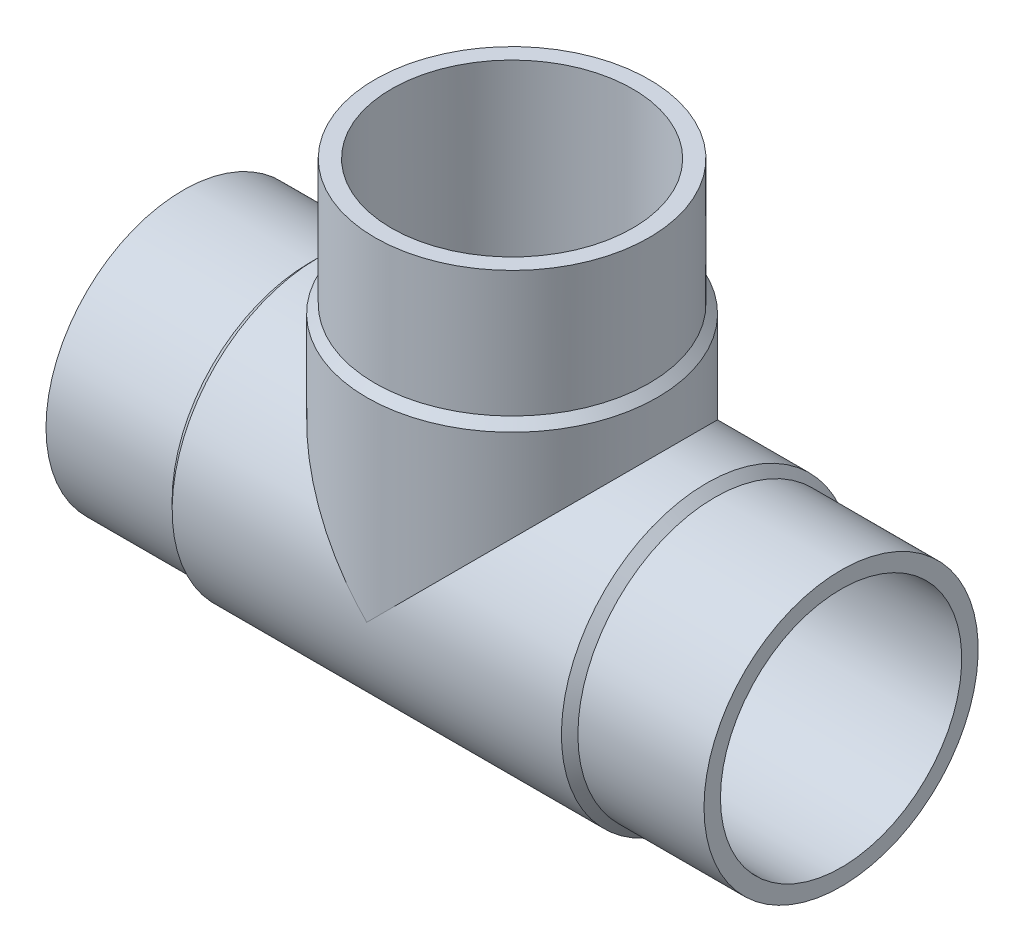
ISO-10303-21;
HEADER;
FILE_DESCRIPTION(('STEP AP214'),'2;1');
FILE_NAME('part.step','',(''),(''),'','','');
FILE_SCHEMA(('AUTOMOTIVE_DESIGN { 1 0 10303 214 1 1 1 1 }'));
ENDSEC;
DATA;
#1=APPLICATION_CONTEXT('core data for automotive mechanical design processes');
#2=APPLICATION_PROTOCOL_DEFINITION('international standard','automotive_design',2000,#1);
#3=PRODUCT_CONTEXT('',#1,'mechanical');
#4=PRODUCT('Part','Part','',(#3));
#5=PRODUCT_RELATED_PRODUCT_CATEGORY('part','',(#4));
#6=PRODUCT_DEFINITION_FORMATION('','',#4);
#7=PRODUCT_DEFINITION_CONTEXT('part definition',#1,'design');
#8=PRODUCT_DEFINITION('design','',#6,#7);
#9=PRODUCT_DEFINITION_SHAPE('','',#8);
#10=(LENGTH_UNIT() NAMED_UNIT(*) SI_UNIT(.MILLI.,.METRE.));
#11=(NAMED_UNIT(*) PLANE_ANGLE_UNIT() SI_UNIT($,.RADIAN.));
#12=(NAMED_UNIT(*) SI_UNIT($,.STERADIAN.) SOLID_ANGLE_UNIT());
#13=UNCERTAINTY_MEASURE_WITH_UNIT(LENGTH_MEASURE(1.E-05),#10,'distance_accuracy_value','');
#14=(GEOMETRIC_REPRESENTATION_CONTEXT(3) GLOBAL_UNCERTAINTY_ASSIGNED_CONTEXT((#13)) GLOBAL_UNIT_ASSIGNED_CONTEXT((#10,
#11,#12)) REPRESENTATION_CONTEXT('',''));
#15=CARTESIAN_POINT('',(0.,0.,0.));
#16=DIRECTION('',(0.,0.,1.));
#17=DIRECTION('',(1.,0.,0.));
#18=AXIS2_PLACEMENT_3D('',#15,#16,#17);
#19=CARTESIAN_POINT('',(-60.,60.,0.));
#20=DIRECTION('',(0.,1.,0.));
#21=DIRECTION('',(0.,0.,1.));
#22=AXIS2_PLACEMENT_3D('',#19,#20,#21);
#23=CYLINDRICAL_SURFACE('',#22,25.);
#24=CARTESIAN_POINT('',(-60.,60.,0.));
#25=DIRECTION('',(0.,1.,0.));
#26=DIRECTION('',(0.,0.,1.));
#27=AXIS2_PLACEMENT_3D('',#24,#25,#26);
#28=CIRCLE('',#27,25.);
#29=CARTESIAN_POINT('',(-60.,60.,25.));
#30=VERTEX_POINT('',#29);
#31=EDGE_CURVE('E18',#30,#30,#28,.T.);
#32=ORIENTED_EDGE('',*,*,#31,.F.);
#33=EDGE_LOOP('',(#32));
#34=FACE_BOUND('',#33,.T.);
#35=CARTESIAN_POINT('',(-60.,37.,0.));
#36=DIRECTION('',(0.,1.,0.));
#37=DIRECTION('',(1.,0.,0.));
#38=AXIS2_PLACEMENT_3D('',#35,#36,#37);
#39=CIRCLE('',#38,25.);
#40=CARTESIAN_POINT('',(-35.,37.,0.));
#41=VERTEX_POINT('',#40);
#42=EDGE_CURVE('E71',#41,#41,#39,.F.);
#43=ORIENTED_EDGE('',*,*,#42,.F.);
#44=EDGE_LOOP('',(#43));
#45=FACE_BOUND('',#44,.T.);
#46=ADVANCED_FACE('F15',(#34,#45),#23,.T.);
#47=CARTESIAN_POINT('',(-60.,37.,0.));
#48=DIRECTION('',(0.,-1.,0.));
#49=DIRECTION('',(0.,0.,-1.));
#50=AXIS2_PLACEMENT_3D('',#47,#48,#49);
#51=CONICAL_SURFACE('',#50,25.,0.785398163397451);
#52=CARTESIAN_POINT('',(-60.,35.5,0.));
#53=DIRECTION('',(0.,1.,0.));
#54=DIRECTION('',(1.,0.,0.));
#55=AXIS2_PLACEMENT_3D('',#52,#53,#54);
#56=CIRCLE('',#55,26.5);
#57=CARTESIAN_POINT('',(-33.5,35.5,0.));
#58=VERTEX_POINT('',#57);
#59=EDGE_CURVE('E60',#58,#58,#56,.F.);
#60=ORIENTED_EDGE('',*,*,#59,.F.);
#61=EDGE_LOOP('',(#60));
#62=FACE_BOUND('',#61,.T.);
#63=ORIENTED_EDGE('',*,*,#42,.T.);
#64=EDGE_LOOP('',(#63));
#65=FACE_BOUND('',#64,.T.);
#66=ADVANCED_FACE('F141',(#62,#65),#51,.T.);
#67=CARTESIAN_POINT('',(-23.,0.,0.));
#68=DIRECTION('',(-1.,0.,0.));
#69=DIRECTION('',(0.,0.,1.));
#70=AXIS2_PLACEMENT_3D('',#67,#68,#69);
#71=CYLINDRICAL_SURFACE('',#70,25.);
#72=CARTESIAN_POINT('',(-23.,0.,0.));
#73=DIRECTION('',(1.,0.,0.));
#74=DIRECTION('',(0.,1.,0.));
#75=AXIS2_PLACEMENT_3D('',#72,#73,#74);
#76=CIRCLE('',#75,25.);
#77=CARTESIAN_POINT('',(-23.,25.,0.));
#78=VERTEX_POINT('',#77);
#79=EDGE_CURVE('E64',#78,#78,#76,.F.);
#80=ORIENTED_EDGE('',*,*,#79,.F.);
#81=EDGE_LOOP('',(#80));
#82=FACE_BOUND('',#81,.T.);
#83=CARTESIAN_POINT('',(0.,0.,0.));
#84=DIRECTION('',(-1.,0.,0.));
#85=DIRECTION('',(0.,0.,1.));
#86=AXIS2_PLACEMENT_3D('',#83,#84,#85);
#87=CIRCLE('',#86,25.);
#88=CARTESIAN_POINT('',(0.,0.,25.));
#89=VERTEX_POINT('',#88);
#90=EDGE_CURVE('E58',#89,#89,#87,.F.);
#91=ORIENTED_EDGE('',*,*,#90,.F.);
#92=EDGE_LOOP('',(#91));
#93=FACE_BOUND('',#92,.T.);
#94=ADVANCED_FACE('F136',(#82,#93),#71,.T.);
#95=CARTESIAN_POINT('',(-85.,60.,25.3000021082717));
#96=DIRECTION('',(0.,1.,0.));
#97=DIRECTION('',(1.,0.,0.));
#98=AXIS2_PLACEMENT_3D('',#95,#96,#97);
#99=PLANE('',#98);
#100=CARTESIAN_POINT('',(-60.,60.,0.));
#101=DIRECTION('',(0.,1.,0.));
#102=DIRECTION('',(0.,0.,1.));
#103=AXIS2_PLACEMENT_3D('',#100,#101,#102);
#104=CIRCLE('',#103,22.);
#105=CARTESIAN_POINT('',(-60.,60.,22.));
#106=VERTEX_POINT('',#105);
#107=EDGE_CURVE('E52',#106,#106,#104,.T.);
#108=ORIENTED_EDGE('',*,*,#107,.F.);
#109=EDGE_LOOP('',(#108));
#110=FACE_BOUND('',#109,.T.);
#111=ORIENTED_EDGE('',*,*,#31,.T.);
#112=EDGE_LOOP('',(#111));
#113=FACE_BOUND('',#112,.T.);
#114=ADVANCED_FACE('F130',(#110,#113),#99,.T.);
#115=CARTESIAN_POINT('',(-23.,0.,0.));
#116=DIRECTION('',(-1.,0.,0.));
#117=DIRECTION('',(0.,0.,1.));
#118=AXIS2_PLACEMENT_3D('',#115,#116,#117);
#119=CONICAL_SURFACE('',#118,25.,0.785398163397447);
#120=ORIENTED_EDGE('',*,*,#79,.T.);
#121=EDGE_LOOP('',(#120));
#122=FACE_BOUND('',#121,.T.);
#123=CARTESIAN_POINT('',(-24.5,0.,0.));
#124=DIRECTION('',(-1.,0.,0.));
#125=DIRECTION('',(0.,1.,0.));
#126=AXIS2_PLACEMENT_3D('',#123,#124,#125);
#127=CIRCLE('',#126,26.5);
#128=CARTESIAN_POINT('',(-24.5,26.5,0.));
#129=VERTEX_POINT('',#128);
#130=EDGE_CURVE('E49',#129,#129,#127,.T.);
#131=ORIENTED_EDGE('',*,*,#130,.F.);
#132=EDGE_LOOP('',(#131));
#133=FACE_BOUND('',#132,.T.);
#134=ADVANCED_FACE('F95',(#122,#133),#119,.T.);
#135=CARTESIAN_POINT('',(-60.,35.5,0.));
#136=DIRECTION('',(0.,1.,0.));
#137=DIRECTION('',(0.,0.,1.));
#138=AXIS2_PLACEMENT_3D('',#135,#136,#137);
#139=CYLINDRICAL_SURFACE('',#138,26.5);
#140=CARTESIAN_POINT('',(-60.,0.,0.));
#141=DIRECTION('',(0.707106781186547,0.707106781186547,0.));
#142=DIRECTION('',(-0.707106781186547,0.707106781186547,0.));
#143=AXIS2_PLACEMENT_3D('',#140,#141,#142);
#144=ELLIPSE('',#143,37.476659402887,26.5);
#145=CARTESIAN_POINT('',(-60.,0.,26.5));
#146=VERTEX_POINT('',#145);
#147=CARTESIAN_POINT('',(-60.,0.,-26.5));
#148=VERTEX_POINT('',#147);
#149=EDGE_CURVE('E44',#146,#148,#144,.F.);
#150=ORIENTED_EDGE('',*,*,#149,.F.);
#151=CARTESIAN_POINT('',(-60.,0.,0.));
#152=DIRECTION('',(-0.707106781186547,0.707106781186547,0.));
#153=DIRECTION('',(0.707106781186547,0.707106781186547,0.));
#154=AXIS2_PLACEMENT_3D('',#151,#152,#153);
#155=ELLIPSE('',#154,37.476659402887,26.5);
#156=EDGE_CURVE('E40',#148,#146,#155,.F.);
#157=ORIENTED_EDGE('',*,*,#156,.F.);
#158=EDGE_LOOP('',(#150,#157));
#159=FACE_BOUND('',#158,.T.);
#160=ORIENTED_EDGE('',*,*,#59,.T.);
#161=EDGE_LOOP('',(#160));
#162=FACE_BOUND('',#161,.T.);
#163=ADVANCED_FACE('F47',(#159,#162),#139,.T.);
#164=CARTESIAN_POINT('',(0.,25.,25.3000021083545));
#165=DIRECTION('',(1.,0.,0.));
#166=DIRECTION('',(0.,-1.,0.));
#167=AXIS2_PLACEMENT_3D('',#164,#165,#166);
#168=PLANE('',#167);
#169=CARTESIAN_POINT('',(0.,0.,0.));
#170=DIRECTION('',(-1.,0.,0.));
#171=DIRECTION('',(0.,0.,1.));
#172=AXIS2_PLACEMENT_3D('',#169,#170,#171);
#173=CIRCLE('',#172,22.);
#174=CARTESIAN_POINT('',(0.,0.,22.));
#175=VERTEX_POINT('',#174);
#176=EDGE_CURVE('E45',#175,#175,#173,.F.);
#177=ORIENTED_EDGE('',*,*,#176,.F.);
#178=EDGE_LOOP('',(#177));
#179=FACE_BOUND('',#178,.T.);
#180=ORIENTED_EDGE('',*,*,#90,.T.);
#181=EDGE_LOOP('',(#180));
#182=FACE_BOUND('',#181,.T.);
#183=ADVANCED_FACE('F85',(#179,#182),#168,.T.);
#184=CARTESIAN_POINT('',(-60.,0.,0.));
#185=DIRECTION('',(0.,1.,0.));
#186=DIRECTION('',(0.,0.,1.));
#187=AXIS2_PLACEMENT_3D('',#184,#185,#186);
#188=CYLINDRICAL_SURFACE('',#187,22.);
#189=CARTESIAN_POINT('',(-60.,0.,0.));
#190=DIRECTION('',(-0.707106781186547,-0.707106781186547,0.));
#191=DIRECTION('',(-0.707106781186547,0.707106781186547,0.));
#192=AXIS2_PLACEMENT_3D('',#189,#190,#191);
#193=ELLIPSE('',#192,31.1126983722081,22.);
#194=CARTESIAN_POINT('',(-60.,0.,-22.));
#195=VERTEX_POINT('',#194);
#196=CARTESIAN_POINT('',(-60.,0.,22.));
#197=VERTEX_POINT('',#196);
#198=EDGE_CURVE('E78',#195,#197,#193,.F.);
#199=ORIENTED_EDGE('',*,*,#198,.F.);
#200=CARTESIAN_POINT('',(-60.,0.,0.));
#201=DIRECTION('',(-0.707106781186547,0.707106781186547,0.));
#202=DIRECTION('',(0.707106781186547,0.707106781186547,0.));
#203=AXIS2_PLACEMENT_3D('',#200,#201,#202);
#204=ELLIPSE('',#203,31.1126983722081,22.);
#205=EDGE_CURVE('E32',#195,#197,#204,.F.);
#206=ORIENTED_EDGE('',*,*,#205,.T.);
#207=EDGE_LOOP('',(#199,#206));
#208=FACE_BOUND('',#207,.T.);
#209=ORIENTED_EDGE('',*,*,#107,.T.);
#210=EDGE_LOOP('',(#209));
#211=FACE_BOUND('',#210,.T.);
#212=ADVANCED_FACE('F87',(#208,#211),#188,.F.);
#213=CARTESIAN_POINT('',(-95.5,0.,0.));
#214=DIRECTION('',(-1.,0.,0.));
#215=DIRECTION('',(0.,0.,1.));
#216=AXIS2_PLACEMENT_3D('',#213,#214,#215);
#217=CYLINDRICAL_SURFACE('',#216,26.5);
#218=ORIENTED_EDGE('',*,*,#130,.T.);
#219=EDGE_LOOP('',(#218));
#220=FACE_BOUND('',#219,.T.);
#221=CARTESIAN_POINT('',(-95.5,0.,0.));
#222=DIRECTION('',(-1.,0.,0.));
#223=DIRECTION('',(0.,1.,0.));
#224=AXIS2_PLACEMENT_3D('',#221,#222,#223);
#225=CIRCLE('',#224,26.5);
#226=CARTESIAN_POINT('',(-95.5,26.5,0.));
#227=VERTEX_POINT('',#226);
#228=EDGE_CURVE('E77',#227,#227,#225,.T.);
#229=ORIENTED_EDGE('',*,*,#228,.F.);
#230=EDGE_LOOP('',(#229));
#231=FACE_BOUND('',#230,.T.);
#232=ORIENTED_EDGE('',*,*,#149,.T.);
#233=ORIENTED_EDGE('',*,*,#156,.T.);
#234=EDGE_LOOP('',(#232,#233));
#235=FACE_BOUND('',#234,.T.);
#236=ADVANCED_FACE('F43',(#220,#231,#235),#217,.T.);
#237=CARTESIAN_POINT('',(-60.,0.,0.));
#238=DIRECTION('',(-1.,0.,0.));
#239=DIRECTION('',(0.,0.,1.));
#240=AXIS2_PLACEMENT_3D('',#237,#238,#239);
#241=CYLINDRICAL_SURFACE('',#240,22.);
#242=ORIENTED_EDGE('',*,*,#205,.F.);
#243=ORIENTED_EDGE('',*,*,#198,.T.);
#244=EDGE_LOOP('',(#242,#243));
#245=FACE_BOUND('',#244,.T.);
#246=ORIENTED_EDGE('',*,*,#176,.T.);
#247=EDGE_LOOP('',(#246));
#248=FACE_BOUND('',#247,.T.);
#249=CARTESIAN_POINT('',(-120.,0.,0.));
#250=DIRECTION('',(-1.,0.,0.));
#251=DIRECTION('',(0.,0.,1.));
#252=AXIS2_PLACEMENT_3D('',#249,#250,#251);
#253=CIRCLE('',#252,22.);
#254=CARTESIAN_POINT('',(-120.,0.,22.));
#255=VERTEX_POINT('',#254);
#256=EDGE_CURVE('E74',#255,#255,#253,.F.);
#257=ORIENTED_EDGE('',*,*,#256,.F.);
#258=EDGE_LOOP('',(#257));
#259=FACE_BOUND('',#258,.T.);
#260=ADVANCED_FACE('F82',(#245,#248,#259),#241,.F.);
#261=CARTESIAN_POINT('',(-97.,0.,0.));
#262=DIRECTION('',(1.,0.,0.));
#263=DIRECTION('',(0.,0.,-1.));
#264=AXIS2_PLACEMENT_3D('',#261,#262,#263);
#265=CONICAL_SURFACE('',#264,25.,0.785398163397447);
#266=ORIENTED_EDGE('',*,*,#228,.T.);
#267=EDGE_LOOP('',(#266));
#268=FACE_BOUND('',#267,.T.);
#269=CARTESIAN_POINT('',(-97.,0.,0.));
#270=DIRECTION('',(-1.,0.,0.));
#271=DIRECTION('',(0.,1.,0.));
#272=AXIS2_PLACEMENT_3D('',#269,#270,#271);
#273=CIRCLE('',#272,25.);
#274=CARTESIAN_POINT('',(-97.,25.,0.));
#275=VERTEX_POINT('',#274);
#276=EDGE_CURVE('E24',#275,#275,#273,.T.);
#277=ORIENTED_EDGE('',*,*,#276,.F.);
#278=EDGE_LOOP('',(#277));
#279=FACE_BOUND('',#278,.T.);
#280=ADVANCED_FACE('F105',(#268,#279),#265,.T.);
#281=CARTESIAN_POINT('',(-120.,-25.,25.3000021084363));
#282=DIRECTION('',(-1.,0.,0.));
#283=DIRECTION('',(0.,1.,0.));
#284=AXIS2_PLACEMENT_3D('',#281,#282,#283);
#285=PLANE('',#284);
#286=ORIENTED_EDGE('',*,*,#256,.T.);
#287=EDGE_LOOP('',(#286));
#288=FACE_BOUND('',#287,.T.);
#289=CARTESIAN_POINT('',(-120.,0.,0.));
#290=DIRECTION('',(-1.,0.,0.));
#291=DIRECTION('',(0.,0.,1.));
#292=AXIS2_PLACEMENT_3D('',#289,#290,#291);
#293=CIRCLE('',#292,25.);
#294=CARTESIAN_POINT('',(-120.,0.,25.));
#295=VERTEX_POINT('',#294);
#296=EDGE_CURVE('E9',#295,#295,#293,.F.);
#297=ORIENTED_EDGE('',*,*,#296,.F.);
#298=EDGE_LOOP('',(#297));
#299=FACE_BOUND('',#298,.T.);
#300=ADVANCED_FACE('F99',(#288,#299),#285,.T.);
#301=CARTESIAN_POINT('',(-120.,0.,0.));
#302=DIRECTION('',(-1.,0.,0.));
#303=DIRECTION('',(0.,0.,1.));
#304=AXIS2_PLACEMENT_3D('',#301,#302,#303);
#305=CYLINDRICAL_SURFACE('',#304,25.);
#306=ORIENTED_EDGE('',*,*,#276,.T.);
#307=EDGE_LOOP('',(#306));
#308=FACE_BOUND('',#307,.T.);
#309=ORIENTED_EDGE('',*,*,#296,.T.);
#310=EDGE_LOOP('',(#309));
#311=FACE_BOUND('',#310,.T.);
#312=ADVANCED_FACE('F97',(#308,#311),#305,.T.);
#313=CLOSED_SHELL('',(#46,#66,#94,#114,#134,#163,#183,#212,#236,#260,#280,#300,#312));
#314=MANIFOLD_SOLID_BREP('B1',#313);
#315=ADVANCED_BREP_SHAPE_REPRESENTATION('',(#18,#314),#14);
#316=SHAPE_DEFINITION_REPRESENTATION(#9,#315);
ENDSEC;
END-ISO-10303-21;
